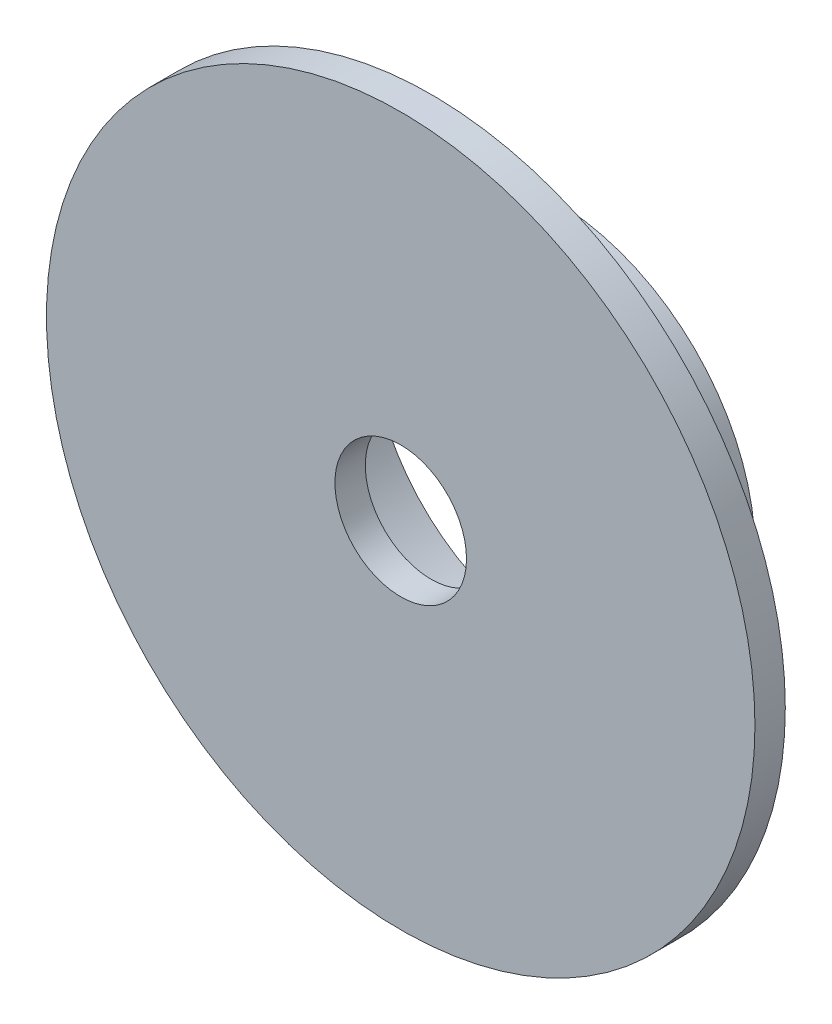
ISO-10303-21;
HEADER;
FILE_DESCRIPTION(('STEP AP214'),'2;1');
FILE_NAME('part.step','',(''),(''),'','','');
FILE_SCHEMA(('AUTOMOTIVE_DESIGN { 1 0 10303 214 1 1 1 1 }'));
ENDSEC;
DATA;
#1=APPLICATION_CONTEXT('core data for automotive mechanical design processes');
#2=APPLICATION_PROTOCOL_DEFINITION('international standard','automotive_design',2000,#1);
#3=PRODUCT_CONTEXT('',#1,'mechanical');
#4=PRODUCT('Part','Part','',(#3));
#5=PRODUCT_RELATED_PRODUCT_CATEGORY('part','',(#4));
#6=PRODUCT_DEFINITION_FORMATION('','',#4);
#7=PRODUCT_DEFINITION_CONTEXT('part definition',#1,'design');
#8=PRODUCT_DEFINITION('design','',#6,#7);
#9=PRODUCT_DEFINITION_SHAPE('','',#8);
#10=(LENGTH_UNIT() NAMED_UNIT(*) SI_UNIT(.MILLI.,.METRE.));
#11=(NAMED_UNIT(*) PLANE_ANGLE_UNIT() SI_UNIT($,.RADIAN.));
#12=(NAMED_UNIT(*) SI_UNIT($,.STERADIAN.) SOLID_ANGLE_UNIT());
#13=UNCERTAINTY_MEASURE_WITH_UNIT(LENGTH_MEASURE(1.E-05),#10,'distance_accuracy_value','');
#14=(GEOMETRIC_REPRESENTATION_CONTEXT(3) GLOBAL_UNCERTAINTY_ASSIGNED_CONTEXT((#13)) GLOBAL_UNIT_ASSIGNED_CONTEXT((#10,
#11,#12)) REPRESENTATION_CONTEXT('',''));
#15=CARTESIAN_POINT('',(0.,0.,0.));
#16=DIRECTION('',(0.,0.,1.));
#17=DIRECTION('',(1.,0.,0.));
#18=AXIS2_PLACEMENT_3D('',#15,#16,#17);
#19=CARTESIAN_POINT('',(0.,0.,7.5));
#20=DIRECTION('',(0.,0.,-1.));
#21=DIRECTION('',(-1.,0.,0.));
#22=AXIS2_PLACEMENT_3D('',#19,#20,#21);
#23=CYLINDRICAL_SURFACE('',#22,10.);
#24=CARTESIAN_POINT('',(0.,0.,6.));
#25=DIRECTION('',(0.,0.,1.));
#26=DIRECTION('',(1.,0.,0.));
#27=AXIS2_PLACEMENT_3D('',#24,#25,#26);
#28=CIRCLE('',#27,10.);
#29=CARTESIAN_POINT('',(-9.97183533758956,0.750000000000036,6.));
#30=VERTEX_POINT('',#29);
#31=CARTESIAN_POINT('',(-0.749999999999999,9.97183533758957,6.));
#32=VERTEX_POINT('',#31);
#33=EDGE_CURVE('E54',#30,#32,#28,.F.);
#34=ORIENTED_EDGE('',*,*,#33,.T.);
#35=DIRECTION('',(0.,0.,-1.));
#36=VECTOR('',#35,1.);
#37=CARTESIAN_POINT('',(-0.749999999999999,9.97183533758957,7.82032657879816));
#38=LINE('',#37,#36);
#39=CARTESIAN_POINT('',(-0.749999999999999,9.97183533758957,3.));
#40=VERTEX_POINT('',#39);
#41=EDGE_CURVE('E275',#32,#40,#38,.T.);
#42=ORIENTED_EDGE('',*,*,#41,.T.);
#43=CARTESIAN_POINT('',(0.,0.,3.));
#44=DIRECTION('',(0.,0.,-1.));
#45=DIRECTION('',(-1.,0.,0.));
#46=AXIS2_PLACEMENT_3D('',#43,#44,#45);
#47=CIRCLE('',#46,10.);
#48=CARTESIAN_POINT('',(-0.249999999999999,9.9968745115661,3.));
#49=VERTEX_POINT('',#48);
#50=EDGE_CURVE('E448',#40,#49,#47,.T.);
#51=ORIENTED_EDGE('',*,*,#50,.T.);
#52=DIRECTION('',(0.,0.,1.));
#53=VECTOR('',#52,1.);
#54=CARTESIAN_POINT('',(-0.249999999999999,9.9968745115661,-1.14330746605721));
#55=LINE('',#54,#53);
#56=CARTESIAN_POINT('',(-0.249999999999999,9.9968745115661,0.));
#57=VERTEX_POINT('',#56);
#58=EDGE_CURVE('E446',#57,#49,#55,.T.);
#59=ORIENTED_EDGE('',*,*,#58,.F.);
#60=CARTESIAN_POINT('',(0.,0.,0.));
#61=DIRECTION('',(0.,0.,1.));
#62=DIRECTION('',(1.,0.,0.));
#63=AXIS2_PLACEMENT_3D('',#60,#61,#62);
#64=CIRCLE('',#63,10.);
#65=CARTESIAN_POINT('',(-9.97183533758956,0.750000000000036,0.));
#66=VERTEX_POINT('',#65);
#67=EDGE_CURVE('E46',#57,#66,#64,.T.);
#68=ORIENTED_EDGE('',*,*,#67,.T.);
#69=DIRECTION('',(0.,0.,-1.));
#70=VECTOR('',#69,1.);
#71=CARTESIAN_POINT('',(-9.97183533758956,0.750000000000036,7.82032657879817));
#72=LINE('',#71,#70);
#73=EDGE_CURVE('E324',#30,#66,#72,.T.);
#74=ORIENTED_EDGE('',*,*,#73,.F.);
#75=EDGE_LOOP('',(#34,#42,#51,#59,#68,#74));
#76=FACE_BOUND('',#75,.T.);
#77=ADVANCED_FACE('F38',(#76),#23,.T.);
#78=CARTESIAN_POINT('',(-0.750000000000001,-9.97183533758957,6.));
#79=VERTEX_POINT('',#78);
#80=CARTESIAN_POINT('',(-9.97183533758957,-0.749999999999964,6.));
#81=VERTEX_POINT('',#80);
#82=EDGE_CURVE('E484',#79,#81,#28,.F.);
#83=ORIENTED_EDGE('',*,*,#82,.T.);
#84=DIRECTION('',(0.,0.,-1.));
#85=VECTOR('',#84,1.);
#86=CARTESIAN_POINT('',(-9.97183533758957,-0.749999999999964,7.82032657879817));
#87=LINE('',#86,#85);
#88=CARTESIAN_POINT('',(-9.97183533758957,-0.749999999999964,0.));
#89=VERTEX_POINT('',#88);
#90=EDGE_CURVE('E320',#81,#89,#87,.T.);
#91=ORIENTED_EDGE('',*,*,#90,.T.);
#92=CARTESIAN_POINT('',(-0.750000000000001,-9.97183533758957,0.));
#93=VERTEX_POINT('',#92);
#94=EDGE_CURVE('E47',#89,#93,#64,.T.);
#95=ORIENTED_EDGE('',*,*,#94,.T.);
#96=DIRECTION('',(0.,0.,-1.));
#97=VECTOR('',#96,1.);
#98=CARTESIAN_POINT('',(-0.750000000000001,-9.97183533758957,7.82032657879816));
#99=LINE('',#98,#97);
#100=EDGE_CURVE('E344',#79,#93,#99,.T.);
#101=ORIENTED_EDGE('',*,*,#100,.F.);
#102=EDGE_LOOP('',(#83,#91,#95,#101));
#103=FACE_BOUND('',#102,.T.);
#104=ADVANCED_FACE('F389',(#103),#23,.T.);
#105=CARTESIAN_POINT('',(0.25,9.9968745115661,6.));
#106=VERTEX_POINT('',#105);
#107=CARTESIAN_POINT('',(0.749999999999999,-9.97183533758957,6.));
#108=VERTEX_POINT('',#107);
#109=EDGE_CURVE('E62',#106,#108,#28,.F.);
#110=ORIENTED_EDGE('',*,*,#109,.T.);
#111=DIRECTION('',(0.,0.,-1.));
#112=VECTOR('',#111,1.);
#113=CARTESIAN_POINT('',(0.749999999999999,-9.97183533758957,7.82032657879816));
#114=LINE('',#113,#112);
#115=CARTESIAN_POINT('',(0.749999999999999,-9.97183533758957,0.));
#116=VERTEX_POINT('',#115);
#117=EDGE_CURVE('E338',#108,#116,#114,.T.);
#118=ORIENTED_EDGE('',*,*,#117,.T.);
#119=CARTESIAN_POINT('',(0.750000000000001,9.97183533758957,0.));
#120=VERTEX_POINT('',#119);
#121=EDGE_CURVE('E12',#116,#120,#64,.T.);
#122=ORIENTED_EDGE('',*,*,#121,.T.);
#123=DIRECTION('',(0.,0.,-1.));
#124=VECTOR('',#123,1.);
#125=CARTESIAN_POINT('',(0.750000000000001,9.97183533758957,7.82032657879816));
#126=LINE('',#125,#124);
#127=CARTESIAN_POINT('',(0.750000000000001,9.97183533758957,3.));
#128=VERTEX_POINT('',#127);
#129=EDGE_CURVE('E304',#128,#120,#126,.T.);
#130=ORIENTED_EDGE('',*,*,#129,.F.);
#131=CARTESIAN_POINT('',(0.,0.,3.));
#132=DIRECTION('',(0.,0.,-1.));
#133=DIRECTION('',(-1.,0.,0.));
#134=AXIS2_PLACEMENT_3D('',#131,#132,#133);
#135=CIRCLE('',#134,10.);
#136=CARTESIAN_POINT('',(0.25,9.9968745115661,3.));
#137=VERTEX_POINT('',#136);
#138=EDGE_CURVE('E234',#137,#128,#135,.T.);
#139=ORIENTED_EDGE('',*,*,#138,.F.);
#140=DIRECTION('',(0.,0.,1.));
#141=VECTOR('',#140,1.);
#142=CARTESIAN_POINT('',(0.25,9.9968745115661,3.));
#143=LINE('',#142,#141);
#144=EDGE_CURVE('E230',#137,#106,#143,.T.);
#145=ORIENTED_EDGE('',*,*,#144,.T.);
#146=EDGE_LOOP('',(#110,#118,#122,#130,#139,#145));
#147=FACE_BOUND('',#146,.T.);
#148=ADVANCED_FACE('F390',(#147),#23,.T.);
#149=CARTESIAN_POINT('',(-0.749999999999999,0.,7.82032657879816));
#150=DIRECTION('',(-1.,0.,0.));
#151=DIRECTION('',(0.,0.,1.));
#152=AXIS2_PLACEMENT_3D('',#149,#150,#151);
#153=PLANE('',#152);
#154=DIRECTION('',(0.,1.,0.));
#155=VECTOR('',#154,1.);
#156=CARTESIAN_POINT('',(-0.749999999999999,0.,3.));
#157=LINE('',#156,#155);
#158=CARTESIAN_POINT('',(-0.749999999999999,8.96869555732605,3.));
#159=VERTEX_POINT('',#158);
#160=EDGE_CURVE('E497',#159,#40,#157,.T.);
#161=ORIENTED_EDGE('',*,*,#160,.T.);
#162=ORIENTED_EDGE('',*,*,#41,.F.);
#163=CARTESIAN_POINT('',(-0.749999999999999,9.97183533758957,6.5));
#164=VERTEX_POINT('',#163);
#165=EDGE_CURVE('E306',#164,#32,#38,.T.);
#166=ORIENTED_EDGE('',*,*,#165,.F.);
#167=DIRECTION('',(0.,1.,0.));
#168=VECTOR('',#167,1.);
#169=CARTESIAN_POINT('',(-0.749999999999999,9.97183533758957,6.5));
#170=LINE('',#169,#168);
#171=CARTESIAN_POINT('',(-0.749999999999999,7.964766161037,6.5));
#172=VERTEX_POINT('',#171);
#173=EDGE_CURVE('E221',#172,#164,#170,.T.);
#174=ORIENTED_EDGE('',*,*,#173,.F.);
#175=DIRECTION('',(0.,0.,-1.));
#176=VECTOR('',#175,1.);
#177=CARTESIAN_POINT('',(-0.749999999999999,7.964766161037,6.5));
#178=LINE('',#177,#176);
#179=CARTESIAN_POINT('',(-0.749999999999999,7.964766161037,6.));
#180=VERTEX_POINT('',#179);
#181=EDGE_CURVE('E259',#172,#180,#178,.T.);
#182=ORIENTED_EDGE('',*,*,#181,.T.);
#183=DIRECTION('',(0.,1.,0.));
#184=VECTOR('',#183,1.);
#185=CARTESIAN_POINT('',(-0.749999999999999,9.97183533758957,6.));
#186=LINE('',#185,#184);
#187=CARTESIAN_POINT('',(-0.749999999999999,8.96869555732605,6.));
#188=VERTEX_POINT('',#187);
#189=EDGE_CURVE('E242',#180,#188,#186,.T.);
#190=ORIENTED_EDGE('',*,*,#189,.T.);
#191=DIRECTION('',(0.,0.,-1.));
#192=VECTOR('',#191,1.);
#193=CARTESIAN_POINT('',(-0.749999999999999,8.96869555732605,7.82032657879816));
#194=LINE('',#193,#192);
#195=EDGE_CURVE('E301',#188,#159,#194,.T.);
#196=ORIENTED_EDGE('',*,*,#195,.T.);
#197=EDGE_LOOP('',(#161,#162,#166,#174,#182,#190,#196));
#198=FACE_BOUND('',#197,.T.);
#199=ADVANCED_FACE('F396',(#198),#153,.F.);
#200=CARTESIAN_POINT('',(0.,0.,6.5));
#201=DIRECTION('',(0.,0.,-1.));
#202=DIRECTION('',(-1.,0.,0.));
#203=AXIS2_PLACEMENT_3D('',#200,#201,#202);
#204=PLANE('',#203);
#205=DIRECTION('',(0.,1.,0.));
#206=VECTOR('',#205,1.);
#207=CARTESIAN_POINT('',(0.250000000000001,9.9968745115661,6.5));
#208=LINE('',#207,#206);
#209=CARTESIAN_POINT('',(0.250000000000001,8.99652710772329,6.5));
#210=VERTEX_POINT('',#209);
#211=CARTESIAN_POINT('',(0.250000000000001,9.9968745115661,6.5));
#212=VERTEX_POINT('',#211);
#213=EDGE_CURVE('E202',#210,#212,#208,.T.);
#214=ORIENTED_EDGE('',*,*,#213,.F.);
#215=CARTESIAN_POINT('',(0.,0.,6.5));
#216=DIRECTION('',(0.,0.,-1.));
#217=DIRECTION('',(-1.,0.,0.));
#218=AXIS2_PLACEMENT_3D('',#215,#216,#217);
#219=CIRCLE('',#218,9.);
#220=CARTESIAN_POINT('',(0.749999999999999,-8.96869555732605,6.5));
#221=VERTEX_POINT('',#220);
#222=EDGE_CURVE('E239',#210,#221,#219,.T.);
#223=ORIENTED_EDGE('',*,*,#222,.T.);
#224=DIRECTION('',(0.,-1.,0.));
#225=VECTOR('',#224,1.);
#226=CARTESIAN_POINT('',(0.749999999999999,-8.96869555732605,6.5));
#227=LINE('',#226,#225);
#228=CARTESIAN_POINT('',(0.75,-9.97183533758957,6.5));
#229=VERTEX_POINT('',#228);
#230=EDGE_CURVE('E241',#221,#229,#227,.T.);
#231=ORIENTED_EDGE('',*,*,#230,.T.);
#232=CARTESIAN_POINT('',(0.,0.,6.5));
#233=DIRECTION('',(0.,0.,-1.));
#234=DIRECTION('',(-1.,0.,0.));
#235=AXIS2_PLACEMENT_3D('',#232,#233,#234);
#236=CIRCLE('',#235,10.);
#237=CARTESIAN_POINT('',(-0.750000000000001,-9.97183533758957,6.5));
#238=VERTEX_POINT('',#237);
#239=EDGE_CURVE('E245',#229,#238,#236,.T.);
#240=ORIENTED_EDGE('',*,*,#239,.T.);
#241=DIRECTION('',(0.,1.,0.));
#242=VECTOR('',#241,1.);
#243=CARTESIAN_POINT('',(-0.750000000000001,-9.97183533758957,6.5));
#244=LINE('',#243,#242);
#245=CARTESIAN_POINT('',(-0.750000000000001,-7.964766161037,6.5));
#246=VERTEX_POINT('',#245);
#247=EDGE_CURVE('E248',#238,#246,#244,.T.);
#248=ORIENTED_EDGE('',*,*,#247,.T.);
#249=CARTESIAN_POINT('',(0.,0.,6.5));
#250=DIRECTION('',(0.,0.,1.));
#251=DIRECTION('',(-1.,0.,0.));
#252=AXIS2_PLACEMENT_3D('',#249,#250,#251);
#253=CIRCLE('',#252,8.);
#254=EDGE_CURVE('E251',#246,#172,#253,.T.);
#255=ORIENTED_EDGE('',*,*,#254,.T.);
#256=ORIENTED_EDGE('',*,*,#173,.T.);
#257=CARTESIAN_POINT('',(0.,0.,6.5));
#258=DIRECTION('',(0.,0.,-1.));
#259=DIRECTION('',(-1.,0.,0.));
#260=AXIS2_PLACEMENT_3D('',#257,#258,#259);
#261=CIRCLE('',#260,10.);
#262=EDGE_CURVE('E217',#164,#212,#261,.T.);
#263=ORIENTED_EDGE('',*,*,#262,.T.);
#264=EDGE_LOOP('',(#214,#223,#231,#240,#248,#255,#256,#263));
#265=FACE_BOUND('',#264,.T.);
#266=ADVANCED_FACE('F218',(#265),#204,.T.);
#267=CARTESIAN_POINT('',(0.,0.,6.));
#268=DIRECTION('',(0.,0.,1.));
#269=DIRECTION('',(1.,0.,0.));
#270=AXIS2_PLACEMENT_3D('',#267,#268,#269);
#271=PLANE('',#270);
#272=CARTESIAN_POINT('',(0.,0.,6.));
#273=DIRECTION('',(0.,0.,1.));
#274=DIRECTION('',(1.,0.,0.));
#275=AXIS2_PLACEMENT_3D('',#272,#273,#274);
#276=CIRCLE('',#275,3.25);
#277=CARTESIAN_POINT('',(3.25,0.,6.));
#278=VERTEX_POINT('',#277);
#279=EDGE_CURVE('E41',#278,#278,#276,.T.);
#280=ORIENTED_EDGE('',*,*,#279,.T.);
#281=EDGE_LOOP('',(#280));
#282=FACE_BOUND('',#281,.T.);
#283=CARTESIAN_POINT('',(0.,0.,6.));
#284=DIRECTION('',(0.,0.,1.));
#285=DIRECTION('',(1.,0.,0.));
#286=AXIS2_PLACEMENT_3D('',#283,#284,#285);
#287=CIRCLE('',#286,9.);
#288=CARTESIAN_POINT('',(-8.96869555732605,0.750000000000033,6.));
#289=VERTEX_POINT('',#288);
#290=EDGE_CURVE('E355',#188,#289,#287,.T.);
#291=ORIENTED_EDGE('',*,*,#290,.F.);
#292=ORIENTED_EDGE('',*,*,#189,.F.);
#293=CARTESIAN_POINT('',(0.,0.,6.));
#294=DIRECTION('',(0.,0.,1.));
#295=DIRECTION('',(-1.,0.,0.));
#296=AXIS2_PLACEMENT_3D('',#293,#294,#295);
#297=CIRCLE('',#296,8.);
#298=CARTESIAN_POINT('',(2.73616114660538,7.51754096628726,6.));
#299=VERTEX_POINT('',#298);
#300=EDGE_CURVE('E255',#299,#180,#297,.T.);
#301=ORIENTED_EDGE('',*,*,#300,.F.);
#302=DIRECTION('',(0.342020143325673,0.939692620785907,0.));
#303=VECTOR('',#302,1.);
#304=CARTESIAN_POINT('',(2.73616114660538,7.51754096628726,6.));
#305=LINE('',#304,#303);
#306=CARTESIAN_POINT('',(2.39414100327971,6.57784834550135,6.));
#307=VERTEX_POINT('',#306);
#308=EDGE_CURVE('E278',#307,#299,#305,.T.);
#309=ORIENTED_EDGE('',*,*,#308,.F.);
#310=CARTESIAN_POINT('',(0.,0.,6.));
#311=DIRECTION('',(0.,0.,1.));
#312=DIRECTION('',(-1.,0.,0.));
#313=AXIS2_PLACEMENT_3D('',#310,#311,#312);
#314=CIRCLE('',#313,7.);
#315=CARTESIAN_POINT('',(2.39414100327971,-6.57784834550135,6.));
#316=VERTEX_POINT('',#315);
#317=EDGE_CURVE('E262',#316,#307,#314,.T.);
#318=ORIENTED_EDGE('',*,*,#317,.F.);
#319=DIRECTION('',(-0.342020143325673,0.939692620785907,0.));
#320=VECTOR('',#319,1.);
#321=CARTESIAN_POINT('',(2.73616114660538,-7.51754096628726,6.));
#322=LINE('',#321,#320);
#323=CARTESIAN_POINT('',(2.73616114660538,-7.51754096628726,6.));
#324=VERTEX_POINT('',#323);
#325=EDGE_CURVE('E281',#324,#316,#322,.T.);
#326=ORIENTED_EDGE('',*,*,#325,.F.);
#327=CARTESIAN_POINT('',(-0.750000000000001,-7.964766161037,6.));
#328=VERTEX_POINT('',#327);
#329=EDGE_CURVE('E256',#328,#324,#297,.T.);
#330=ORIENTED_EDGE('',*,*,#329,.F.);
#331=DIRECTION('',(0.,1.,0.));
#332=VECTOR('',#331,1.);
#333=CARTESIAN_POINT('',(-0.750000000000001,-9.97183533758957,6.));
#334=LINE('',#333,#332);
#335=CARTESIAN_POINT('',(-0.750000000000001,-8.96869555732605,6.));
#336=VERTEX_POINT('',#335);
#337=EDGE_CURVE('E238',#336,#328,#334,.T.);
#338=ORIENTED_EDGE('',*,*,#337,.F.);
#339=CARTESIAN_POINT('',(-8.96869555732605,-0.749999999999968,6.));
#340=VERTEX_POINT('',#339);
#341=EDGE_CURVE('E353',#340,#336,#287,.T.);
#342=ORIENTED_EDGE('',*,*,#341,.F.);
#343=DIRECTION('',(-1.,0.,0.));
#344=VECTOR('',#343,1.);
#345=CARTESIAN_POINT('',(0.,-0.749999999999999,6.));
#346=LINE('',#345,#344);
#347=EDGE_CURVE('E317',#340,#81,#346,.T.);
#348=ORIENTED_EDGE('',*,*,#347,.T.);
#349=ORIENTED_EDGE('',*,*,#82,.F.);
#350=EDGE_CURVE('E480',#108,#79,#28,.F.);
#351=ORIENTED_EDGE('',*,*,#350,.F.);
#352=ORIENTED_EDGE('',*,*,#109,.F.);
#353=EDGE_CURVE('E229',#32,#106,#28,.F.);
#354=ORIENTED_EDGE('',*,*,#353,.F.);
#355=ORIENTED_EDGE('',*,*,#33,.F.);
#356=DIRECTION('',(-1.,0.,0.));
#357=VECTOR('',#356,1.);
#358=CARTESIAN_POINT('',(0.,0.750000000000001,6.));
#359=LINE('',#358,#357);
#360=EDGE_CURVE('E309',#289,#30,#359,.T.);
#361=ORIENTED_EDGE('',*,*,#360,.F.);
#362=EDGE_LOOP('',(#291,#292,#301,#309,#318,#326,#330,#338,#342,#348,#349,#351,#352,#354,#355,#361));
#363=FACE_BOUND('',#362,.T.);
#364=CARTESIAN_POINT('',(0.,0.,6.));
#365=DIRECTION('',(0.,0.,1.));
#366=DIRECTION('',(1.,0.,0.));
#367=AXIS2_PLACEMENT_3D('',#364,#365,#366);
#368=CIRCLE('',#367,17.5);
#369=CARTESIAN_POINT('',(17.5,0.,6.));
#370=VERTEX_POINT('',#369);
#371=EDGE_CURVE('E509',#370,#370,#368,.F.);
#372=ORIENTED_EDGE('',*,*,#371,.T.);
#373=EDGE_LOOP('',(#372));
#374=FACE_BOUND('',#373,.T.);
#375=ADVANCED_FACE('F365',(#282,#363,#374),#271,.F.);
#376=CARTESIAN_POINT('',(0.,0.,0.));
#377=DIRECTION('',(0.,0.,1.));
#378=DIRECTION('',(1.,0.,0.));
#379=AXIS2_PLACEMENT_3D('',#376,#377,#378);
#380=PLANE('',#379);
#381=DIRECTION('',(0.,1.,0.));
#382=VECTOR('',#381,1.);
#383=CARTESIAN_POINT('',(0.750000000000001,0.,0.));
#384=LINE('',#383,#382);
#385=CARTESIAN_POINT('',(0.750000000000001,8.96869555732605,0.));
#386=VERTEX_POINT('',#385);
#387=EDGE_CURVE('E298',#386,#120,#384,.T.);
#388=ORIENTED_EDGE('',*,*,#387,.T.);
#389=ORIENTED_EDGE('',*,*,#121,.F.);
#390=DIRECTION('',(0.,-1.,0.));
#391=VECTOR('',#390,1.);
#392=CARTESIAN_POINT('',(0.749999999999999,0.,0.));
#393=LINE('',#392,#391);
#394=CARTESIAN_POINT('',(0.749999999999999,-8.96869555732605,0.));
#395=VERTEX_POINT('',#394);
#396=EDGE_CURVE('E330',#395,#116,#393,.T.);
#397=ORIENTED_EDGE('',*,*,#396,.F.);
#398=CARTESIAN_POINT('',(0.,0.,0.));
#399=DIRECTION('',(0.,0.,1.));
#400=DIRECTION('',(1.,0.,0.));
#401=AXIS2_PLACEMENT_3D('',#398,#399,#400);
#402=CIRCLE('',#401,9.);
#403=EDGE_CURVE('E350',#395,#386,#402,.T.);
#404=ORIENTED_EDGE('',*,*,#403,.T.);
#405=EDGE_LOOP('',(#388,#389,#397,#404));
#406=FACE_BOUND('',#405,.T.);
#407=ADVANCED_FACE('F384',(#406),#380,.F.);
#408=CARTESIAN_POINT('',(0.,0.,32.9558441227157));
#409=DIRECTION('',(0.,0.,-1.));
#410=DIRECTION('',(-1.,0.,0.));
#411=AXIS2_PLACEMENT_3D('',#408,#409,#410);
#412=CYLINDRICAL_SURFACE('',#411,9.);
#413=DIRECTION('',(0.,0.,-1.));
#414=VECTOR('',#413,1.);
#415=CARTESIAN_POINT('',(0.749999999999999,-8.96869555732605,7.82032657879816));
#416=LINE('',#415,#414);
#417=EDGE_CURVE('E334',#221,#395,#416,.T.);
#418=ORIENTED_EDGE('',*,*,#417,.F.);
#419=ORIENTED_EDGE('',*,*,#222,.F.);
#420=DIRECTION('',(0.,0.,1.));
#421=VECTOR('',#420,1.);
#422=CARTESIAN_POINT('',(0.250000000000001,8.99652710772329,3.));
#423=LINE('',#422,#421);
#424=CARTESIAN_POINT('',(0.250000000000001,8.99652710772329,3.));
#425=VERTEX_POINT('',#424);
#426=EDGE_CURVE('E209',#425,#210,#423,.T.);
#427=ORIENTED_EDGE('',*,*,#426,.F.);
#428=CARTESIAN_POINT('',(0.,0.,3.));
#429=DIRECTION('',(0.,0.,1.));
#430=DIRECTION('',(-1.,0.,0.));
#431=AXIS2_PLACEMENT_3D('',#428,#429,#430);
#432=CIRCLE('',#431,9.);
#433=CARTESIAN_POINT('',(0.750000000000001,8.96869555732605,3.));
#434=VERTEX_POINT('',#433);
#435=EDGE_CURVE('E212',#434,#425,#432,.T.);
#436=ORIENTED_EDGE('',*,*,#435,.F.);
#437=DIRECTION('',(0.,0.,-1.));
#438=VECTOR('',#437,1.);
#439=CARTESIAN_POINT('',(0.750000000000001,8.96869555732605,7.82032657879816));
#440=LINE('',#439,#438);
#441=EDGE_CURVE('E302',#434,#386,#440,.T.);
#442=ORIENTED_EDGE('',*,*,#441,.T.);
#443=ORIENTED_EDGE('',*,*,#403,.F.);
#444=EDGE_LOOP('',(#418,#419,#427,#436,#442,#443));
#445=FACE_BOUND('',#444,.T.);
#446=ADVANCED_FACE('F380',(#445),#412,.F.);
#447=ORIENTED_EDGE('',*,*,#67,.F.);
#448=DIRECTION('',(0.,1.,0.));
#449=VECTOR('',#448,1.);
#450=CARTESIAN_POINT('',(-0.25,0.,0.));
#451=LINE('',#450,#449);
#452=CARTESIAN_POINT('',(-0.249999999999999,8.99652710772329,0.));
#453=VERTEX_POINT('',#452);
#454=EDGE_CURVE('E213',#453,#57,#451,.T.);
#455=ORIENTED_EDGE('',*,*,#454,.F.);
#456=CARTESIAN_POINT('',(-8.96869555732605,0.750000000000032,0.));
#457=VERTEX_POINT('',#456);
#458=EDGE_CURVE('E354',#453,#457,#402,.T.);
#459=ORIENTED_EDGE('',*,*,#458,.T.);
#460=DIRECTION('',(-1.,0.,0.));
#461=VECTOR('',#460,1.);
#462=CARTESIAN_POINT('',(0.,0.750000000000001,0.));
#463=LINE('',#462,#461);
#464=EDGE_CURVE('E310',#457,#66,#463,.T.);
#465=ORIENTED_EDGE('',*,*,#464,.T.);
#466=EDGE_LOOP('',(#447,#455,#459,#465));
#467=FACE_BOUND('',#466,.T.);
#468=ADVANCED_FACE('F385',(#467),#380,.F.);
#469=ORIENTED_EDGE('',*,*,#195,.F.);
#470=ORIENTED_EDGE('',*,*,#290,.T.);
#471=DIRECTION('',(0.,0.,-1.));
#472=VECTOR('',#471,1.);
#473=CARTESIAN_POINT('',(-8.96869555732605,0.750000000000032,7.82032657879817));
#474=LINE('',#473,#472);
#475=EDGE_CURVE('E314',#289,#457,#474,.T.);
#476=ORIENTED_EDGE('',*,*,#475,.T.);
#477=ORIENTED_EDGE('',*,*,#458,.F.);
#478=DIRECTION('',(0.,0.,1.));
#479=VECTOR('',#478,1.);
#480=CARTESIAN_POINT('',(-0.249999999999999,8.99652710772329,-1.14330746605721));
#481=LINE('',#480,#479);
#482=CARTESIAN_POINT('',(-0.249999999999999,8.99652710772329,3.));
#483=VERTEX_POINT('',#482);
#484=EDGE_CURVE('E452',#453,#483,#481,.T.);
#485=ORIENTED_EDGE('',*,*,#484,.T.);
#486=CARTESIAN_POINT('',(0.,0.,3.));
#487=DIRECTION('',(0.,0.,-1.));
#488=DIRECTION('',(-1.,0.,0.));
#489=AXIS2_PLACEMENT_3D('',#486,#487,#488);
#490=CIRCLE('',#489,9.);
#491=EDGE_CURVE('E490',#159,#483,#490,.T.);
#492=ORIENTED_EDGE('',*,*,#491,.F.);
#493=EDGE_LOOP('',(#469,#470,#476,#477,#485,#492));
#494=FACE_BOUND('',#493,.T.);
#495=ADVANCED_FACE('F381',(#494),#412,.F.);
#496=CARTESIAN_POINT('',(0.,0.,7.5));
#497=DIRECTION('',(0.,0.,1.));
#498=DIRECTION('',(1.,0.,0.));
#499=AXIS2_PLACEMENT_3D('',#496,#497,#498);
#500=PLANE('',#499);
#501=CARTESIAN_POINT('',(0.,0.,7.5));
#502=DIRECTION('',(0.,0.,1.));
#503=DIRECTION('',(1.,0.,0.));
#504=AXIS2_PLACEMENT_3D('',#501,#502,#503);
#505=CIRCLE('',#504,3.25);
#506=CARTESIAN_POINT('',(3.25,0.,7.5));
#507=VERTEX_POINT('',#506);
#508=EDGE_CURVE('E357',#507,#507,#505,.T.);
#509=ORIENTED_EDGE('',*,*,#508,.F.);
#510=EDGE_LOOP('',(#509));
#511=FACE_BOUND('',#510,.T.);
#512=CARTESIAN_POINT('',(0.,0.,7.5));
#513=DIRECTION('',(0.,0.,1.));
#514=DIRECTION('',(1.,0.,0.));
#515=AXIS2_PLACEMENT_3D('',#512,#513,#514);
#516=CIRCLE('',#515,17.5);
#517=CARTESIAN_POINT('',(17.5,0.,7.5));
#518=VERTEX_POINT('',#517);
#519=EDGE_CURVE('E493',#518,#518,#516,.T.);
#520=ORIENTED_EDGE('',*,*,#519,.T.);
#521=EDGE_LOOP('',(#520));
#522=FACE_BOUND('',#521,.T.);
#523=ADVANCED_FACE('F382',(#511,#522),#500,.T.);
#524=ORIENTED_EDGE('',*,*,#94,.F.);
#525=DIRECTION('',(-1.,0.,0.));
#526=VECTOR('',#525,1.);
#527=CARTESIAN_POINT('',(0.,-0.749999999999999,0.));
#528=LINE('',#527,#526);
#529=CARTESIAN_POINT('',(-8.96869555732605,-0.749999999999968,0.));
#530=VERTEX_POINT('',#529);
#531=EDGE_CURVE('E315',#530,#89,#528,.T.);
#532=ORIENTED_EDGE('',*,*,#531,.F.);
#533=CARTESIAN_POINT('',(-0.750000000000001,-8.96869555732605,0.));
#534=VERTEX_POINT('',#533);
#535=EDGE_CURVE('E349',#530,#534,#402,.T.);
#536=ORIENTED_EDGE('',*,*,#535,.T.);
#537=DIRECTION('',(0.,-1.,0.));
#538=VECTOR('',#537,1.);
#539=CARTESIAN_POINT('',(-0.750000000000001,0.,0.));
#540=LINE('',#539,#538);
#541=EDGE_CURVE('E331',#534,#93,#540,.T.);
#542=ORIENTED_EDGE('',*,*,#541,.T.);
#543=EDGE_LOOP('',(#524,#532,#536,#542));
#544=FACE_BOUND('',#543,.T.);
#545=ADVANCED_FACE('F371',(#544),#380,.F.);
#546=CARTESIAN_POINT('',(0.,0.,7.5));
#547=DIRECTION('',(0.,0.,-1.));
#548=DIRECTION('',(-1.,0.,0.));
#549=AXIS2_PLACEMENT_3D('',#546,#547,#548);
#550=CYLINDRICAL_SURFACE('',#549,3.25);
#551=ORIENTED_EDGE('',*,*,#279,.F.);
#552=EDGE_LOOP('',(#551));
#553=FACE_BOUND('',#552,.T.);
#554=ORIENTED_EDGE('',*,*,#508,.T.);
#555=EDGE_LOOP('',(#554));
#556=FACE_BOUND('',#555,.T.);
#557=ADVANCED_FACE('F368',(#553,#556),#550,.F.);
#558=DIRECTION('',(0.,0.,-1.));
#559=VECTOR('',#558,1.);
#560=CARTESIAN_POINT('',(-8.96869555732605,-0.749999999999968,7.82032657879817));
#561=LINE('',#560,#559);
#562=EDGE_CURVE('E313',#340,#530,#561,.T.);
#563=ORIENTED_EDGE('',*,*,#562,.F.);
#564=ORIENTED_EDGE('',*,*,#341,.T.);
#565=DIRECTION('',(0.,0.,-1.));
#566=VECTOR('',#565,1.);
#567=CARTESIAN_POINT('',(-0.750000000000001,-8.96869555732605,7.82032657879816));
#568=LINE('',#567,#566);
#569=EDGE_CURVE('E335',#336,#534,#568,.T.);
#570=ORIENTED_EDGE('',*,*,#569,.T.);
#571=ORIENTED_EDGE('',*,*,#535,.F.);
#572=EDGE_LOOP('',(#563,#564,#570,#571));
#573=FACE_BOUND('',#572,.T.);
#574=ADVANCED_FACE('F370',(#573),#412,.F.);
#575=CARTESIAN_POINT('',(0.749999999999999,0.,7.82032657879816));
#576=DIRECTION('',(1.,0.,0.));
#577=DIRECTION('',(0.,0.,-1.));
#578=AXIS2_PLACEMENT_3D('',#575,#576,#577);
#579=PLANE('',#578);
#580=ORIENTED_EDGE('',*,*,#417,.T.);
#581=ORIENTED_EDGE('',*,*,#396,.T.);
#582=ORIENTED_EDGE('',*,*,#117,.F.);
#583=EDGE_CURVE('E345',#229,#108,#114,.T.);
#584=ORIENTED_EDGE('',*,*,#583,.F.);
#585=ORIENTED_EDGE('',*,*,#230,.F.);
#586=EDGE_LOOP('',(#580,#581,#582,#584,#585));
#587=FACE_BOUND('',#586,.T.);
#588=ADVANCED_FACE('F377',(#587),#579,.F.);
#589=CARTESIAN_POINT('',(-0.750000000000001,0.,7.82032657879816));
#590=DIRECTION('',(1.,0.,0.));
#591=DIRECTION('',(0.,0.,-1.));
#592=AXIS2_PLACEMENT_3D('',#589,#590,#591);
#593=PLANE('',#592);
#594=ORIENTED_EDGE('',*,*,#569,.F.);
#595=ORIENTED_EDGE('',*,*,#337,.T.);
#596=DIRECTION('',(0.,0.,-1.));
#597=VECTOR('',#596,1.);
#598=CARTESIAN_POINT('',(-0.750000000000001,-7.964766161037,6.5));
#599=LINE('',#598,#597);
#600=EDGE_CURVE('E224',#246,#328,#599,.T.);
#601=ORIENTED_EDGE('',*,*,#600,.F.);
#602=ORIENTED_EDGE('',*,*,#247,.F.);
#603=EDGE_CURVE('E341',#238,#79,#99,.T.);
#604=ORIENTED_EDGE('',*,*,#603,.T.);
#605=ORIENTED_EDGE('',*,*,#100,.T.);
#606=ORIENTED_EDGE('',*,*,#541,.F.);
#607=EDGE_LOOP('',(#594,#595,#601,#602,#604,#605,#606));
#608=FACE_BOUND('',#607,.T.);
#609=ADVANCED_FACE('F418',(#608),#593,.T.);
#610=CARTESIAN_POINT('',(0.,-0.749999999999999,7.82032657879817));
#611=DIRECTION('',(0.,-1.,0.));
#612=DIRECTION('',(1.,0.,0.));
#613=AXIS2_PLACEMENT_3D('',#610,#611,#612);
#614=PLANE('',#613);
#615=ORIENTED_EDGE('',*,*,#562,.T.);
#616=ORIENTED_EDGE('',*,*,#531,.T.);
#617=ORIENTED_EDGE('',*,*,#90,.F.);
#618=ORIENTED_EDGE('',*,*,#347,.F.);
#619=EDGE_LOOP('',(#615,#616,#617,#618));
#620=FACE_BOUND('',#619,.T.);
#621=ADVANCED_FACE('F414',(#620),#614,.F.);
#622=CARTESIAN_POINT('',(0.,0.750000000000001,7.82032657879817));
#623=DIRECTION('',(0.,-1.,0.));
#624=DIRECTION('',(1.,0.,0.));
#625=AXIS2_PLACEMENT_3D('',#622,#623,#624);
#626=PLANE('',#625);
#627=ORIENTED_EDGE('',*,*,#360,.T.);
#628=ORIENTED_EDGE('',*,*,#73,.T.);
#629=ORIENTED_EDGE('',*,*,#464,.F.);
#630=ORIENTED_EDGE('',*,*,#475,.F.);
#631=EDGE_LOOP('',(#627,#628,#629,#630));
#632=FACE_BOUND('',#631,.T.);
#633=ADVANCED_FACE('F411',(#632),#626,.T.);
#634=CARTESIAN_POINT('',(0.750000000000001,0.,7.82032657879816));
#635=DIRECTION('',(-1.,0.,0.));
#636=DIRECTION('',(0.,0.,1.));
#637=AXIS2_PLACEMENT_3D('',#634,#635,#636);
#638=PLANE('',#637);
#639=DIRECTION('',(0.,-1.,0.));
#640=VECTOR('',#639,1.);
#641=CARTESIAN_POINT('',(0.750000000000001,8.96869555732605,3.));
#642=LINE('',#641,#640);
#643=EDGE_CURVE('E231',#128,#434,#642,.T.);
#644=ORIENTED_EDGE('',*,*,#643,.F.);
#645=ORIENTED_EDGE('',*,*,#129,.T.);
#646=ORIENTED_EDGE('',*,*,#387,.F.);
#647=ORIENTED_EDGE('',*,*,#441,.F.);
#648=EDGE_LOOP('',(#644,#645,#646,#647));
#649=FACE_BOUND('',#648,.T.);
#650=ADVANCED_FACE('F409',(#649),#638,.T.);
#651=CARTESIAN_POINT('',(2.73616114660538,-7.51754096628726,-16.0461628999066));
#652=DIRECTION('',(0.939692620785907,0.342020143325673,0.));
#653=DIRECTION('',(-0.342020143325673,0.939692620785907,0.));
#654=AXIS2_PLACEMENT_3D('',#651,#652,#653);
#655=PLANE('',#654);
#656=DIRECTION('',(0.,0.,1.));
#657=VECTOR('',#656,1.);
#658=CARTESIAN_POINT('',(2.39414100327971,-6.57784834550135,-16.0461628999066));
#659=LINE('',#658,#657);
#660=CARTESIAN_POINT('',(2.39414100327971,-6.57784834550135,0.));
#661=VERTEX_POINT('',#660);
#662=EDGE_CURVE('E284',#661,#316,#659,.T.);
#663=ORIENTED_EDGE('',*,*,#662,.F.);
#664=DIRECTION('',(0.342020143325673,-0.939692620785907,0.));
#665=VECTOR('',#664,1.);
#666=CARTESIAN_POINT('',(2.73616114660538,-7.51754096628726,0.));
#667=LINE('',#666,#665);
#668=CARTESIAN_POINT('',(2.73616114660538,-7.51754096628726,0.));
#669=VERTEX_POINT('',#668);
#670=EDGE_CURVE('E269',#661,#669,#667,.T.);
#671=ORIENTED_EDGE('',*,*,#670,.T.);
#672=DIRECTION('',(0.,0.,1.));
#673=VECTOR('',#672,1.);
#674=CARTESIAN_POINT('',(2.73616114660538,-7.51754096628726,-16.0461628999066));
#675=LINE('',#674,#673);
#676=EDGE_CURVE('E287',#669,#324,#675,.T.);
#677=ORIENTED_EDGE('',*,*,#676,.T.);
#678=ORIENTED_EDGE('',*,*,#325,.T.);
#679=EDGE_LOOP('',(#663,#671,#677,#678));
#680=FACE_BOUND('',#679,.T.);
#681=ADVANCED_FACE('F538',(#680),#655,.F.);
#682=CARTESIAN_POINT('',(0.,0.,-16.0461628999066));
#683=DIRECTION('',(0.,0.,1.));
#684=DIRECTION('',(1.,0.,0.));
#685=AXIS2_PLACEMENT_3D('',#682,#683,#684);
#686=CYLINDRICAL_SURFACE('',#685,8.);
#687=ORIENTED_EDGE('',*,*,#676,.F.);
#688=CARTESIAN_POINT('',(0.,0.,0.));
#689=DIRECTION('',(0.,0.,1.));
#690=DIRECTION('',(1.,0.,0.));
#691=AXIS2_PLACEMENT_3D('',#688,#689,#690);
#692=CIRCLE('',#691,8.);
#693=CARTESIAN_POINT('',(2.73616114660538,7.51754096628726,0.));
#694=VERTEX_POINT('',#693);
#695=EDGE_CURVE('E265',#669,#694,#692,.T.);
#696=ORIENTED_EDGE('',*,*,#695,.T.);
#697=DIRECTION('',(0.,0.,1.));
#698=VECTOR('',#697,1.);
#699=CARTESIAN_POINT('',(2.73616114660538,7.51754096628726,-16.0461628999066));
#700=LINE('',#699,#698);
#701=EDGE_CURVE('E290',#694,#299,#700,.T.);
#702=ORIENTED_EDGE('',*,*,#701,.T.);
#703=ORIENTED_EDGE('',*,*,#300,.T.);
#704=ORIENTED_EDGE('',*,*,#181,.F.);
#705=ORIENTED_EDGE('',*,*,#254,.F.);
#706=ORIENTED_EDGE('',*,*,#600,.T.);
#707=ORIENTED_EDGE('',*,*,#329,.T.);
#708=EDGE_LOOP('',(#687,#696,#702,#703,#704,#705,#706,#707));
#709=FACE_BOUND('',#708,.T.);
#710=ADVANCED_FACE('F541',(#709),#686,.T.);
#711=CARTESIAN_POINT('',(2.73616114660538,7.51754096628726,-16.0461628999066));
#712=DIRECTION('',(0.939692620785907,-0.342020143325673,0.));
#713=DIRECTION('',(0.342020143325673,0.939692620785907,0.));
#714=AXIS2_PLACEMENT_3D('',#711,#712,#713);
#715=PLANE('',#714);
#716=ORIENTED_EDGE('',*,*,#701,.F.);
#717=DIRECTION('',(-0.342020143325673,-0.939692620785907,0.));
#718=VECTOR('',#717,1.);
#719=CARTESIAN_POINT('',(2.73616114660538,7.51754096628726,0.));
#720=LINE('',#719,#718);
#721=CARTESIAN_POINT('',(2.39414100327971,6.57784834550135,0.));
#722=VERTEX_POINT('',#721);
#723=EDGE_CURVE('E268',#694,#722,#720,.T.);
#724=ORIENTED_EDGE('',*,*,#723,.T.);
#725=DIRECTION('',(0.,0.,1.));
#726=VECTOR('',#725,1.);
#727=CARTESIAN_POINT('',(2.39414100327971,6.57784834550135,-16.0461628999066));
#728=LINE('',#727,#726);
#729=EDGE_CURVE('E293',#722,#307,#728,.T.);
#730=ORIENTED_EDGE('',*,*,#729,.T.);
#731=ORIENTED_EDGE('',*,*,#308,.T.);
#732=EDGE_LOOP('',(#716,#724,#730,#731));
#733=FACE_BOUND('',#732,.T.);
#734=ADVANCED_FACE('F545',(#733),#715,.F.);
#735=CARTESIAN_POINT('',(0.,0.,-16.0461628999066));
#736=DIRECTION('',(0.,0.,1.));
#737=DIRECTION('',(1.,0.,0.));
#738=AXIS2_PLACEMENT_3D('',#735,#736,#737);
#739=CYLINDRICAL_SURFACE('',#738,7.);
#740=ORIENTED_EDGE('',*,*,#729,.F.);
#741=CARTESIAN_POINT('',(0.,0.,0.));
#742=DIRECTION('',(0.,0.,1.));
#743=DIRECTION('',(1.,0.,0.));
#744=AXIS2_PLACEMENT_3D('',#741,#742,#743);
#745=CIRCLE('',#744,7.);
#746=EDGE_CURVE('E272',#722,#661,#745,.F.);
#747=ORIENTED_EDGE('',*,*,#746,.T.);
#748=ORIENTED_EDGE('',*,*,#662,.T.);
#749=ORIENTED_EDGE('',*,*,#317,.T.);
#750=EDGE_LOOP('',(#740,#747,#748,#749));
#751=FACE_BOUND('',#750,.T.);
#752=ADVANCED_FACE('F536',(#751),#739,.F.);
#753=CARTESIAN_POINT('',(0.,0.,0.));
#754=DIRECTION('',(0.,0.,1.));
#755=DIRECTION('',(1.,0.,0.));
#756=AXIS2_PLACEMENT_3D('',#753,#754,#755);
#757=PLANE('',#756);
#758=ORIENTED_EDGE('',*,*,#723,.F.);
#759=ORIENTED_EDGE('',*,*,#695,.F.);
#760=ORIENTED_EDGE('',*,*,#670,.F.);
#761=ORIENTED_EDGE('',*,*,#746,.F.);
#762=EDGE_LOOP('',(#758,#759,#760,#761));
#763=FACE_BOUND('',#762,.T.);
#764=ADVANCED_FACE('F532',(#763),#757,.F.);
#765=CARTESIAN_POINT('',(0.250000000000001,9.9968745115661,3.));
#766=DIRECTION('',(1.,0.,0.));
#767=DIRECTION('',(0.,1.,0.));
#768=AXIS2_PLACEMENT_3D('',#765,#766,#767);
#769=PLANE('',#768);
#770=ORIENTED_EDGE('',*,*,#213,.T.);
#771=EDGE_CURVE('E207',#106,#212,#143,.T.);
#772=ORIENTED_EDGE('',*,*,#771,.F.);
#773=ORIENTED_EDGE('',*,*,#144,.F.);
#774=DIRECTION('',(0.,1.,0.));
#775=VECTOR('',#774,1.);
#776=CARTESIAN_POINT('',(0.250000000000001,9.9968745115661,3.));
#777=LINE('',#776,#775);
#778=EDGE_CURVE('E460',#425,#137,#777,.T.);
#779=ORIENTED_EDGE('',*,*,#778,.F.);
#780=ORIENTED_EDGE('',*,*,#426,.T.);
#781=EDGE_LOOP('',(#770,#772,#773,#779,#780));
#782=FACE_BOUND('',#781,.T.);
#783=ADVANCED_FACE('F204',(#782),#769,.F.);
#784=CARTESIAN_POINT('',(0.,0.,3.));
#785=DIRECTION('',(0.,0.,-1.));
#786=DIRECTION('',(-1.,0.,0.));
#787=AXIS2_PLACEMENT_3D('',#784,#785,#786);
#788=PLANE('',#787);
#789=ORIENTED_EDGE('',*,*,#435,.T.);
#790=ORIENTED_EDGE('',*,*,#778,.T.);
#791=ORIENTED_EDGE('',*,*,#138,.T.);
#792=ORIENTED_EDGE('',*,*,#643,.T.);
#793=EDGE_LOOP('',(#789,#790,#791,#792));
#794=FACE_BOUND('',#793,.T.);
#795=ADVANCED_FACE('F465',(#794),#788,.T.);
#796=CARTESIAN_POINT('',(0.,0.,3.));
#797=DIRECTION('',(0.,0.,-1.));
#798=DIRECTION('',(-1.,0.,0.));
#799=AXIS2_PLACEMENT_3D('',#796,#797,#798);
#800=PLANE('',#799);
#801=ORIENTED_EDGE('',*,*,#491,.T.);
#802=DIRECTION('',(0.,-1.,0.));
#803=VECTOR('',#802,1.);
#804=CARTESIAN_POINT('',(-0.25,0.,3.));
#805=LINE('',#804,#803);
#806=EDGE_CURVE('E500',#49,#483,#805,.T.);
#807=ORIENTED_EDGE('',*,*,#806,.F.);
#808=ORIENTED_EDGE('',*,*,#50,.F.);
#809=ORIENTED_EDGE('',*,*,#160,.F.);
#810=EDGE_LOOP('',(#801,#807,#808,#809));
#811=FACE_BOUND('',#810,.T.);
#812=ADVANCED_FACE('F505',(#811),#800,.F.);
#813=CARTESIAN_POINT('',(-0.25,0.,-1.14330746605721));
#814=DIRECTION('',(-1.,0.,0.));
#815=DIRECTION('',(0.,-1.,0.));
#816=AXIS2_PLACEMENT_3D('',#813,#814,#815);
#817=PLANE('',#816);
#818=ORIENTED_EDGE('',*,*,#484,.F.);
#819=ORIENTED_EDGE('',*,*,#454,.T.);
#820=ORIENTED_EDGE('',*,*,#58,.T.);
#821=ORIENTED_EDGE('',*,*,#806,.T.);
#822=EDGE_LOOP('',(#818,#819,#820,#821));
#823=FACE_BOUND('',#822,.T.);
#824=ADVANCED_FACE('F454',(#823),#817,.F.);
#825=CARTESIAN_POINT('',(0.,0.,-43.4974746830583));
#826=DIRECTION('',(0.,0.,1.));
#827=DIRECTION('',(1.,0.,0.));
#828=AXIS2_PLACEMENT_3D('',#825,#826,#827);
#829=CYLINDRICAL_SURFACE('',#828,10.);
#830=ORIENTED_EDGE('',*,*,#239,.F.);
#831=ORIENTED_EDGE('',*,*,#583,.T.);
#832=ORIENTED_EDGE('',*,*,#350,.T.);
#833=ORIENTED_EDGE('',*,*,#603,.F.);
#834=EDGE_LOOP('',(#830,#831,#832,#833));
#835=FACE_BOUND('',#834,.T.);
#836=ADVANCED_FACE('F477',(#835),#829,.F.);
#837=ORIENTED_EDGE('',*,*,#262,.F.);
#838=ORIENTED_EDGE('',*,*,#165,.T.);
#839=ORIENTED_EDGE('',*,*,#353,.T.);
#840=ORIENTED_EDGE('',*,*,#771,.T.);
#841=EDGE_LOOP('',(#837,#838,#839,#840));
#842=FACE_BOUND('',#841,.T.);
#843=ADVANCED_FACE('F227',(#842),#829,.F.);
#844=CARTESIAN_POINT('',(0.,0.,-43.4974746830583));
#845=DIRECTION('',(0.,0.,1.));
#846=DIRECTION('',(1.,0.,0.));
#847=AXIS2_PLACEMENT_3D('',#844,#845,#846);
#848=CYLINDRICAL_SURFACE('',#847,17.5);
#849=ORIENTED_EDGE('',*,*,#371,.F.);
#850=EDGE_LOOP('',(#849));
#851=FACE_BOUND('',#850,.T.);
#852=ORIENTED_EDGE('',*,*,#519,.F.);
#853=EDGE_LOOP('',(#852));
#854=FACE_BOUND('',#853,.T.);
#855=ADVANCED_FACE('F516',(#851,#854),#848,.T.);
#856=CLOSED_SHELL('',(#77,#104,#148,#199,#266,#375,#407,#446,#468,#495,#523,#545,#557,#574,#588,
#609,#621,#633,#650,#681,#710,#734,#752,#764,#783,#795,#812,#824,#836,#843,#855));
#857=MANIFOLD_SOLID_BREP('B2',#856);
#858=ADVANCED_BREP_SHAPE_REPRESENTATION('',(#18,#857),#14);
#859=SHAPE_DEFINITION_REPRESENTATION(#9,#858);
ENDSEC;
END-ISO-10303-21;
